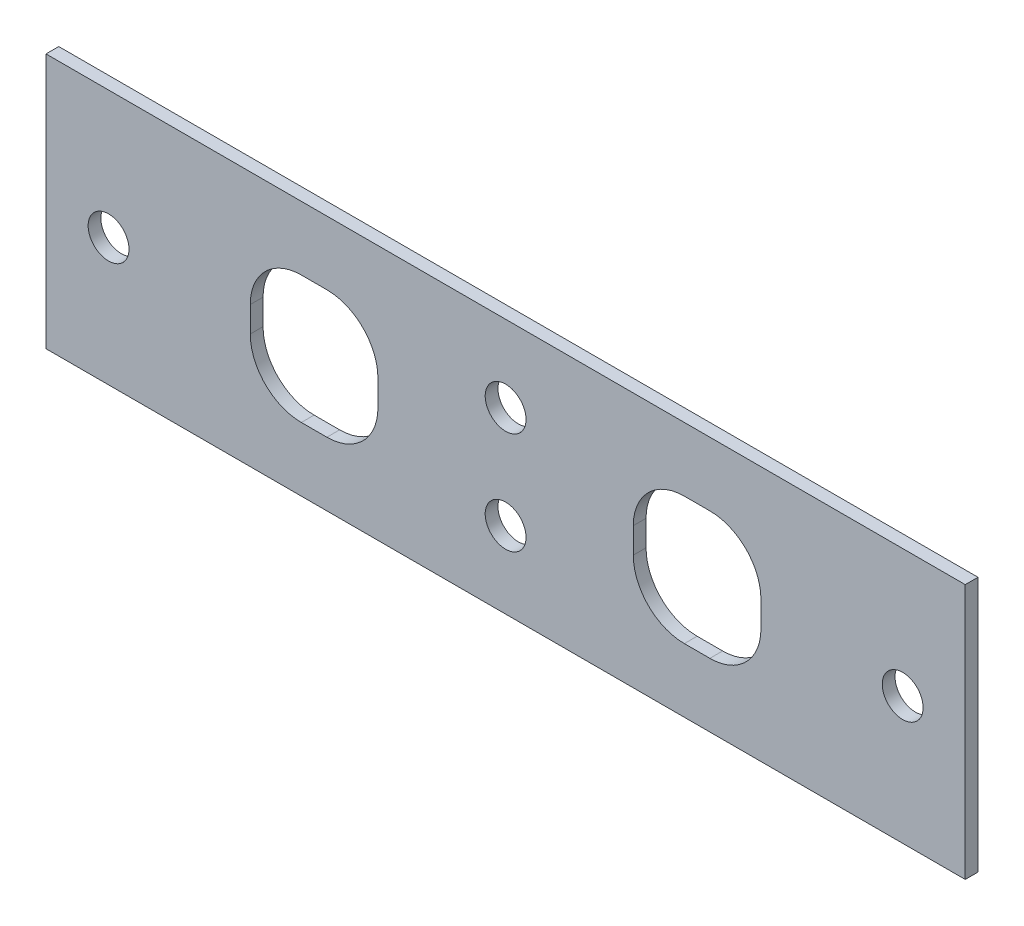
ISO-10303-21;
HEADER;
FILE_DESCRIPTION(('STEP AP214'),'2;1');
FILE_NAME('part.step','',(''),(''),'','','');
FILE_SCHEMA(('AUTOMOTIVE_DESIGN { 1 0 10303 214 1 1 1 1 }'));
ENDSEC;
DATA;
#1=APPLICATION_CONTEXT('core data for automotive mechanical design processes');
#2=APPLICATION_PROTOCOL_DEFINITION('international standard','automotive_design',2000,#1);
#3=PRODUCT_CONTEXT('',#1,'mechanical');
#4=PRODUCT('Part','Part','',(#3));
#5=PRODUCT_RELATED_PRODUCT_CATEGORY('part','',(#4));
#6=PRODUCT_DEFINITION_FORMATION('','',#4);
#7=PRODUCT_DEFINITION_CONTEXT('part definition',#1,'design');
#8=PRODUCT_DEFINITION('design','',#6,#7);
#9=PRODUCT_DEFINITION_SHAPE('','',#8);
#10=(LENGTH_UNIT() NAMED_UNIT(*) SI_UNIT(.MILLI.,.METRE.));
#11=(NAMED_UNIT(*) PLANE_ANGLE_UNIT() SI_UNIT($,.RADIAN.));
#12=(NAMED_UNIT(*) SI_UNIT($,.STERADIAN.) SOLID_ANGLE_UNIT());
#13=UNCERTAINTY_MEASURE_WITH_UNIT(LENGTH_MEASURE(1.E-05),#10,'distance_accuracy_value','');
#14=(GEOMETRIC_REPRESENTATION_CONTEXT(3) GLOBAL_UNCERTAINTY_ASSIGNED_CONTEXT((#13)) GLOBAL_UNIT_ASSIGNED_CONTEXT((#10,
#11,#12)) REPRESENTATION_CONTEXT('',''));
#15=CARTESIAN_POINT('',(0.,0.,0.));
#16=DIRECTION('',(0.,0.,1.));
#17=DIRECTION('',(1.,0.,0.));
#18=AXIS2_PLACEMENT_3D('',#15,#16,#17);
#19=CARTESIAN_POINT('',(0.,0.,0.));
#20=DIRECTION('',(0.,0.,1.));
#21=DIRECTION('',(1.,0.,0.));
#22=AXIS2_PLACEMENT_3D('',#19,#20,#21);
#23=PLANE('',#22);
#24=CARTESIAN_POINT('',(31.1,0.,0.));
#25=DIRECTION('',(0.,0.,1.));
#26=DIRECTION('',(1.,0.,0.));
#27=AXIS2_PLACEMENT_3D('',#24,#25,#26);
#28=CIRCLE('',#27,1.6);
#29=CARTESIAN_POINT('',(32.7,0.,0.));
#30=VERTEX_POINT('',#29);
#31=EDGE_CURVE('E247',#30,#30,#28,.T.);
#32=ORIENTED_EDGE('',*,*,#31,.T.);
#33=EDGE_LOOP('',(#32));
#34=FACE_BOUND('',#33,.T.);
#35=CARTESIAN_POINT('',(-31.1,0.,0.));
#36=DIRECTION('',(0.,0.,1.));
#37=DIRECTION('',(1.,0.,0.));
#38=AXIS2_PLACEMENT_3D('',#35,#36,#37);
#39=CIRCLE('',#38,1.6);
#40=CARTESIAN_POINT('',(-29.5,0.,0.));
#41=VERTEX_POINT('',#40);
#42=EDGE_CURVE('E251',#41,#41,#39,.T.);
#43=ORIENTED_EDGE('',*,*,#42,.T.);
#44=EDGE_LOOP('',(#43));
#45=FACE_BOUND('',#44,.T.);
#46=CARTESIAN_POINT('',(0.,-3.99999999999999,0.));
#47=DIRECTION('',(0.,0.,1.));
#48=DIRECTION('',(1.,0.,0.));
#49=AXIS2_PLACEMENT_3D('',#46,#47,#48);
#50=CIRCLE('',#49,1.6);
#51=CARTESIAN_POINT('',(1.6,-3.99999999999999,0.));
#52=VERTEX_POINT('',#51);
#53=EDGE_CURVE('E254',#52,#52,#50,.T.);
#54=ORIENTED_EDGE('',*,*,#53,.T.);
#55=EDGE_LOOP('',(#54));
#56=FACE_BOUND('',#55,.T.);
#57=CARTESIAN_POINT('',(0.,3.99999999999999,0.));
#58=DIRECTION('',(0.,0.,1.));
#59=DIRECTION('',(1.,0.,0.));
#60=AXIS2_PLACEMENT_3D('',#57,#58,#59);
#61=CIRCLE('',#60,1.6);
#62=CARTESIAN_POINT('',(1.6,3.99999999999999,0.));
#63=VERTEX_POINT('',#62);
#64=EDGE_CURVE('E257',#63,#63,#61,.T.);
#65=ORIENTED_EDGE('',*,*,#64,.T.);
#66=EDGE_LOOP('',(#65));
#67=FACE_BOUND('',#66,.T.);
#68=DIRECTION('',(1.,0.,0.));
#69=VECTOR('',#68,1.);
#70=CARTESIAN_POINT('',(16.,-5.,0.));
#71=LINE('',#70,#69);
#72=CARTESIAN_POINT('',(14.,-5.,0.));
#73=VERTEX_POINT('',#72);
#74=CARTESIAN_POINT('',(16.,-5.,0.));
#75=VERTEX_POINT('',#74);
#76=EDGE_CURVE('E177',#73,#75,#71,.T.);
#77=ORIENTED_EDGE('',*,*,#76,.T.);
#78=CARTESIAN_POINT('',(16.,-1.,0.));
#79=DIRECTION('',(0.,0.,-1.));
#80=DIRECTION('',(-1.,0.,0.));
#81=AXIS2_PLACEMENT_3D('',#78,#79,#80);
#82=CIRCLE('',#81,4.);
#83=CARTESIAN_POINT('',(20.,-1.,0.));
#84=VERTEX_POINT('',#83);
#85=EDGE_CURVE('E260',#75,#84,#82,.F.);
#86=ORIENTED_EDGE('',*,*,#85,.T.);
#87=DIRECTION('',(0.,1.,0.));
#88=VECTOR('',#87,1.);
#89=CARTESIAN_POINT('',(20.,0.999999999999999,0.));
#90=LINE('',#89,#88);
#91=CARTESIAN_POINT('',(20.,1.,0.));
#92=VERTEX_POINT('',#91);
#93=EDGE_CURVE('E180',#84,#92,#90,.T.);
#94=ORIENTED_EDGE('',*,*,#93,.T.);
#95=CARTESIAN_POINT('',(16.,1.,0.));
#96=DIRECTION('',(0.,0.,-1.));
#97=DIRECTION('',(-1.,0.,0.));
#98=AXIS2_PLACEMENT_3D('',#95,#96,#97);
#99=CIRCLE('',#98,4.);
#100=CARTESIAN_POINT('',(16.,5.,0.));
#101=VERTEX_POINT('',#100);
#102=EDGE_CURVE('E263',#92,#101,#99,.F.);
#103=ORIENTED_EDGE('',*,*,#102,.T.);
#104=DIRECTION('',(-1.,0.,0.));
#105=VECTOR('',#104,1.);
#106=CARTESIAN_POINT('',(14.,5.,0.));
#107=LINE('',#106,#105);
#108=CARTESIAN_POINT('',(14.,5.,0.));
#109=VERTEX_POINT('',#108);
#110=EDGE_CURVE('E184',#101,#109,#107,.T.);
#111=ORIENTED_EDGE('',*,*,#110,.T.);
#112=CARTESIAN_POINT('',(14.,1.,0.));
#113=DIRECTION('',(0.,0.,-1.));
#114=DIRECTION('',(-1.,0.,0.));
#115=AXIS2_PLACEMENT_3D('',#112,#113,#114);
#116=CIRCLE('',#115,4.);
#117=CARTESIAN_POINT('',(10.,1.,0.));
#118=VERTEX_POINT('',#117);
#119=EDGE_CURVE('E265',#109,#118,#116,.F.);
#120=ORIENTED_EDGE('',*,*,#119,.T.);
#121=DIRECTION('',(0.,1.,0.));
#122=VECTOR('',#121,1.);
#123=CARTESIAN_POINT('',(10.,-1.,0.));
#124=LINE('',#123,#122);
#125=CARTESIAN_POINT('',(10.,-1.,0.));
#126=VERTEX_POINT('',#125);
#127=EDGE_CURVE('E188',#118,#126,#124,.F.);
#128=ORIENTED_EDGE('',*,*,#127,.T.);
#129=CARTESIAN_POINT('',(14.,-1.,0.));
#130=DIRECTION('',(0.,0.,-1.));
#131=DIRECTION('',(-1.,0.,0.));
#132=AXIS2_PLACEMENT_3D('',#129,#130,#131);
#133=CIRCLE('',#132,4.);
#134=EDGE_CURVE('E191',#126,#73,#133,.F.);
#135=ORIENTED_EDGE('',*,*,#134,.T.);
#136=EDGE_LOOP('',(#77,#86,#94,#103,#111,#120,#128,#135));
#137=FACE_BOUND('',#136,.T.);
#138=DIRECTION('',(1.,0.,0.));
#139=VECTOR('',#138,1.);
#140=CARTESIAN_POINT('',(-14.,-5.,0.));
#141=LINE('',#140,#139);
#142=CARTESIAN_POINT('',(-16.,-5.,0.));
#143=VERTEX_POINT('',#142);
#144=CARTESIAN_POINT('',(-14.,-5.,0.));
#145=VERTEX_POINT('',#144);
#146=EDGE_CURVE('E192',#143,#145,#141,.T.);
#147=ORIENTED_EDGE('',*,*,#146,.T.);
#148=CARTESIAN_POINT('',(-14.,-1.,0.));
#149=DIRECTION('',(0.,0.,-1.));
#150=DIRECTION('',(-1.,0.,0.));
#151=AXIS2_PLACEMENT_3D('',#148,#149,#150);
#152=CIRCLE('',#151,4.);
#153=CARTESIAN_POINT('',(-10.,-1.,0.));
#154=VERTEX_POINT('',#153);
#155=EDGE_CURVE('E268',#145,#154,#152,.F.);
#156=ORIENTED_EDGE('',*,*,#155,.T.);
#157=DIRECTION('',(0.,1.,0.));
#158=VECTOR('',#157,1.);
#159=CARTESIAN_POINT('',(-10.,1.,0.));
#160=LINE('',#159,#158);
#161=CARTESIAN_POINT('',(-10.,1.,0.));
#162=VERTEX_POINT('',#161);
#163=EDGE_CURVE('E196',#154,#162,#160,.T.);
#164=ORIENTED_EDGE('',*,*,#163,.T.);
#165=CARTESIAN_POINT('',(-14.,1.,0.));
#166=DIRECTION('',(0.,0.,-1.));
#167=DIRECTION('',(-1.,0.,0.));
#168=AXIS2_PLACEMENT_3D('',#165,#166,#167);
#169=CIRCLE('',#168,4.);
#170=CARTESIAN_POINT('',(-14.,5.,0.));
#171=VERTEX_POINT('',#170);
#172=EDGE_CURVE('E271',#162,#171,#169,.F.);
#173=ORIENTED_EDGE('',*,*,#172,.T.);
#174=DIRECTION('',(-1.,0.,0.));
#175=VECTOR('',#174,1.);
#176=CARTESIAN_POINT('',(-16.,5.,0.));
#177=LINE('',#176,#175);
#178=CARTESIAN_POINT('',(-16.,5.,0.));
#179=VERTEX_POINT('',#178);
#180=EDGE_CURVE('E200',#171,#179,#177,.T.);
#181=ORIENTED_EDGE('',*,*,#180,.T.);
#182=CARTESIAN_POINT('',(-16.,1.,0.));
#183=DIRECTION('',(0.,0.,-1.));
#184=DIRECTION('',(-1.,0.,0.));
#185=AXIS2_PLACEMENT_3D('',#182,#183,#184);
#186=CIRCLE('',#185,4.);
#187=CARTESIAN_POINT('',(-20.,1.,0.));
#188=VERTEX_POINT('',#187);
#189=EDGE_CURVE('E272',#179,#188,#186,.F.);
#190=ORIENTED_EDGE('',*,*,#189,.T.);
#191=DIRECTION('',(0.,1.,0.));
#192=VECTOR('',#191,1.);
#193=CARTESIAN_POINT('',(-20.,-1.,0.));
#194=LINE('',#193,#192);
#195=CARTESIAN_POINT('',(-20.,-1.,0.));
#196=VERTEX_POINT('',#195);
#197=EDGE_CURVE('E131',#188,#196,#194,.F.);
#198=ORIENTED_EDGE('',*,*,#197,.T.);
#199=CARTESIAN_POINT('',(-16.,-1.,0.));
#200=DIRECTION('',(0.,0.,-1.));
#201=DIRECTION('',(-1.,0.,0.));
#202=AXIS2_PLACEMENT_3D('',#199,#200,#201);
#203=CIRCLE('',#202,4.);
#204=EDGE_CURVE('E19',#196,#143,#203,.F.);
#205=ORIENTED_EDGE('',*,*,#204,.T.);
#206=EDGE_LOOP('',(#147,#156,#164,#173,#181,#190,#198,#205));
#207=FACE_BOUND('',#206,.T.);
#208=DIRECTION('',(0.,1.,0.));
#209=VECTOR('',#208,1.);
#210=CARTESIAN_POINT('',(36.,10.,0.));
#211=LINE('',#210,#209);
#212=CARTESIAN_POINT('',(36.,-9.99999999999999,0.));
#213=VERTEX_POINT('',#212);
#214=CARTESIAN_POINT('',(36.,10.,0.));
#215=VERTEX_POINT('',#214);
#216=EDGE_CURVE('E140',#213,#215,#211,.T.);
#217=ORIENTED_EDGE('',*,*,#216,.F.);
#218=DIRECTION('',(1.,0.,0.));
#219=VECTOR('',#218,1.);
#220=CARTESIAN_POINT('',(36.,-10.,0.));
#221=LINE('',#220,#219);
#222=CARTESIAN_POINT('',(-36.,-9.99999999999999,0.));
#223=VERTEX_POINT('',#222);
#224=EDGE_CURVE('E282',#223,#213,#221,.T.);
#225=ORIENTED_EDGE('',*,*,#224,.F.);
#226=DIRECTION('',(0.,-1.,0.));
#227=VECTOR('',#226,1.);
#228=CARTESIAN_POINT('',(-36.,-9.99999999999999,0.));
#229=LINE('',#228,#227);
#230=CARTESIAN_POINT('',(-36.,10.,0.));
#231=VERTEX_POINT('',#230);
#232=EDGE_CURVE('E164',#231,#223,#229,.T.);
#233=ORIENTED_EDGE('',*,*,#232,.F.);
#234=DIRECTION('',(1.,0.,0.));
#235=VECTOR('',#234,1.);
#236=CARTESIAN_POINT('',(-36.,10.,0.));
#237=LINE('',#236,#235);
#238=EDGE_CURVE('E163',#215,#231,#237,.F.);
#239=ORIENTED_EDGE('',*,*,#238,.F.);
#240=EDGE_LOOP('',(#217,#225,#233,#239));
#241=FACE_BOUND('',#240,.T.);
#242=ADVANCED_FACE('F16',(#34,#45,#56,#67,#137,#207,#241),#23,.F.);
#243=CARTESIAN_POINT('',(36.,10.,0.));
#244=DIRECTION('',(1.,0.,0.));
#245=DIRECTION('',(0.,1.,0.));
#246=AXIS2_PLACEMENT_3D('',#243,#244,#245);
#247=PLANE('',#246);
#248=ORIENTED_EDGE('',*,*,#216,.T.);
#249=DIRECTION('',(0.,0.,1.));
#250=VECTOR('',#249,1.);
#251=CARTESIAN_POINT('',(36.,10.,0.));
#252=LINE('',#251,#250);
#253=CARTESIAN_POINT('',(36.,10.,1.));
#254=VERTEX_POINT('',#253);
#255=EDGE_CURVE('E156',#254,#215,#252,.F.);
#256=ORIENTED_EDGE('',*,*,#255,.F.);
#257=DIRECTION('',(0.,1.,0.));
#258=VECTOR('',#257,1.);
#259=CARTESIAN_POINT('',(36.,0.,1.));
#260=LINE('',#259,#258);
#261=CARTESIAN_POINT('',(36.,-10.,1.));
#262=VERTEX_POINT('',#261);
#263=EDGE_CURVE('E250',#262,#254,#260,.T.);
#264=ORIENTED_EDGE('',*,*,#263,.F.);
#265=DIRECTION('',(0.,0.,1.));
#266=VECTOR('',#265,1.);
#267=CARTESIAN_POINT('',(36.,-10.,0.));
#268=LINE('',#267,#266);
#269=EDGE_CURVE('E159',#213,#262,#268,.T.);
#270=ORIENTED_EDGE('',*,*,#269,.F.);
#271=EDGE_LOOP('',(#248,#256,#264,#270));
#272=FACE_BOUND('',#271,.T.);
#273=ADVANCED_FACE('F153',(#272),#247,.T.);
#274=CARTESIAN_POINT('',(-36.,10.,0.));
#275=DIRECTION('',(0.,1.,0.));
#276=DIRECTION('',(0.,0.,1.));
#277=AXIS2_PLACEMENT_3D('',#274,#275,#276);
#278=PLANE('',#277);
#279=ORIENTED_EDGE('',*,*,#238,.T.);
#280=DIRECTION('',(0.,0.,1.));
#281=VECTOR('',#280,1.);
#282=CARTESIAN_POINT('',(-36.,10.,0.));
#283=LINE('',#282,#281);
#284=CARTESIAN_POINT('',(-36.,10.,1.));
#285=VERTEX_POINT('',#284);
#286=EDGE_CURVE('E168',#285,#231,#283,.F.);
#287=ORIENTED_EDGE('',*,*,#286,.F.);
#288=DIRECTION('',(1.,0.,0.));
#289=VECTOR('',#288,1.);
#290=CARTESIAN_POINT('',(0.,10.,1.));
#291=LINE('',#290,#289);
#292=EDGE_CURVE('E172',#254,#285,#291,.F.);
#293=ORIENTED_EDGE('',*,*,#292,.F.);
#294=ORIENTED_EDGE('',*,*,#255,.T.);
#295=EDGE_LOOP('',(#279,#287,#293,#294));
#296=FACE_BOUND('',#295,.T.);
#297=ADVANCED_FACE('F170',(#296),#278,.T.);
#298=CARTESIAN_POINT('',(-36.,-9.99999999999999,0.));
#299=DIRECTION('',(-1.,0.,0.));
#300=DIRECTION('',(0.,-1.,0.));
#301=AXIS2_PLACEMENT_3D('',#298,#299,#300);
#302=PLANE('',#301);
#303=ORIENTED_EDGE('',*,*,#232,.T.);
#304=DIRECTION('',(0.,0.,1.));
#305=VECTOR('',#304,1.);
#306=CARTESIAN_POINT('',(-36.,-9.99999999999999,0.));
#307=LINE('',#306,#305);
#308=CARTESIAN_POINT('',(-36.,-9.99999999999999,1.));
#309=VERTEX_POINT('',#308);
#310=EDGE_CURVE('E284',#309,#223,#307,.F.);
#311=ORIENTED_EDGE('',*,*,#310,.F.);
#312=DIRECTION('',(0.,1.,0.));
#313=VECTOR('',#312,1.);
#314=CARTESIAN_POINT('',(-36.,0.,1.));
#315=LINE('',#314,#313);
#316=EDGE_CURVE('E293',#285,#309,#315,.F.);
#317=ORIENTED_EDGE('',*,*,#316,.F.);
#318=ORIENTED_EDGE('',*,*,#286,.T.);
#319=EDGE_LOOP('',(#303,#311,#317,#318));
#320=FACE_BOUND('',#319,.T.);
#321=ADVANCED_FACE('F289',(#320),#302,.T.);
#322=CARTESIAN_POINT('',(36.,-10.,0.));
#323=DIRECTION('',(0.,-1.,0.));
#324=DIRECTION('',(1.,0.,0.));
#325=AXIS2_PLACEMENT_3D('',#322,#323,#324);
#326=PLANE('',#325);
#327=ORIENTED_EDGE('',*,*,#224,.T.);
#328=ORIENTED_EDGE('',*,*,#269,.T.);
#329=DIRECTION('',(1.,0.,0.));
#330=VECTOR('',#329,1.);
#331=CARTESIAN_POINT('',(0.,-9.99999999999999,1.));
#332=LINE('',#331,#330);
#333=EDGE_CURVE('E246',#309,#262,#332,.T.);
#334=ORIENTED_EDGE('',*,*,#333,.F.);
#335=ORIENTED_EDGE('',*,*,#310,.T.);
#336=EDGE_LOOP('',(#327,#328,#334,#335));
#337=FACE_BOUND('',#336,.T.);
#338=ADVANCED_FACE('F301',(#337),#326,.T.);
#339=CARTESIAN_POINT('',(-16.,-1.,1.));
#340=DIRECTION('',(0.,0.,-1.));
#341=DIRECTION('',(-1.,0.,0.));
#342=AXIS2_PLACEMENT_3D('',#339,#340,#341);
#343=CYLINDRICAL_SURFACE('',#342,4.);
#344=DIRECTION('',(0.,0.,1.));
#345=VECTOR('',#344,1.);
#346=CARTESIAN_POINT('',(-16.,-5.,1.));
#347=LINE('',#346,#345);
#348=CARTESIAN_POINT('',(-16.,-5.,1.));
#349=VERTEX_POINT('',#348);
#350=EDGE_CURVE('E195',#349,#143,#347,.F.);
#351=ORIENTED_EDGE('',*,*,#350,.T.);
#352=ORIENTED_EDGE('',*,*,#204,.F.);
#353=DIRECTION('',(0.,0.,1.));
#354=VECTOR('',#353,1.);
#355=CARTESIAN_POINT('',(-20.,-1.,1.));
#356=LINE('',#355,#354);
#357=CARTESIAN_POINT('',(-20.,-1.,1.));
#358=VERTEX_POINT('',#357);
#359=EDGE_CURVE('E204',#196,#358,#356,.T.);
#360=ORIENTED_EDGE('',*,*,#359,.T.);
#361=CARTESIAN_POINT('',(-16.,-1.,1.));
#362=DIRECTION('',(0.,0.,-1.));
#363=DIRECTION('',(-1.,0.,0.));
#364=AXIS2_PLACEMENT_3D('',#361,#362,#363);
#365=CIRCLE('',#364,4.);
#366=EDGE_CURVE('E243',#349,#358,#365,.T.);
#367=ORIENTED_EDGE('',*,*,#366,.F.);
#368=EDGE_LOOP('',(#351,#352,#360,#367));
#369=FACE_BOUND('',#368,.T.);
#370=ADVANCED_FACE('F341',(#369),#343,.F.);
#371=CARTESIAN_POINT('',(-20.,-1.,1.));
#372=DIRECTION('',(-1.,0.,0.));
#373=DIRECTION('',(0.,0.,1.));
#374=AXIS2_PLACEMENT_3D('',#371,#372,#373);
#375=PLANE('',#374);
#376=ORIENTED_EDGE('',*,*,#359,.F.);
#377=ORIENTED_EDGE('',*,*,#197,.F.);
#378=DIRECTION('',(0.,0.,-1.));
#379=VECTOR('',#378,1.);
#380=CARTESIAN_POINT('',(-20.,1.,1.));
#381=LINE('',#380,#379);
#382=CARTESIAN_POINT('',(-20.,1.,1.));
#383=VERTEX_POINT('',#382);
#384=EDGE_CURVE('E203',#188,#383,#381,.F.);
#385=ORIENTED_EDGE('',*,*,#384,.T.);
#386=DIRECTION('',(0.,1.,0.));
#387=VECTOR('',#386,1.);
#388=CARTESIAN_POINT('',(-20.,0.,1.));
#389=LINE('',#388,#387);
#390=EDGE_CURVE('E242',#358,#383,#389,.T.);
#391=ORIENTED_EDGE('',*,*,#390,.F.);
#392=EDGE_LOOP('',(#376,#377,#385,#391));
#393=FACE_BOUND('',#392,.T.);
#394=ADVANCED_FACE('F339',(#393),#375,.F.);
#395=CARTESIAN_POINT('',(-16.,1.,1.));
#396=DIRECTION('',(0.,0.,-1.));
#397=DIRECTION('',(-1.,0.,0.));
#398=AXIS2_PLACEMENT_3D('',#395,#396,#397);
#399=CYLINDRICAL_SURFACE('',#398,4.);
#400=ORIENTED_EDGE('',*,*,#384,.F.);
#401=ORIENTED_EDGE('',*,*,#189,.F.);
#402=DIRECTION('',(0.,0.,1.));
#403=VECTOR('',#402,1.);
#404=CARTESIAN_POINT('',(-16.,5.,1.));
#405=LINE('',#404,#403);
#406=CARTESIAN_POINT('',(-16.,5.,1.));
#407=VERTEX_POINT('',#406);
#408=EDGE_CURVE('E202',#179,#407,#405,.T.);
#409=ORIENTED_EDGE('',*,*,#408,.T.);
#410=CARTESIAN_POINT('',(-16.,1.,1.));
#411=DIRECTION('',(0.,0.,-1.));
#412=DIRECTION('',(-1.,0.,0.));
#413=AXIS2_PLACEMENT_3D('',#410,#411,#412);
#414=CIRCLE('',#413,4.);
#415=EDGE_CURVE('E239',#383,#407,#414,.T.);
#416=ORIENTED_EDGE('',*,*,#415,.F.);
#417=EDGE_LOOP('',(#400,#401,#409,#416));
#418=FACE_BOUND('',#417,.T.);
#419=ADVANCED_FACE('F328',(#418),#399,.F.);
#420=CARTESIAN_POINT('',(-16.,5.,1.));
#421=DIRECTION('',(0.,1.,0.));
#422=DIRECTION('',(-1.,0.,0.));
#423=AXIS2_PLACEMENT_3D('',#420,#421,#422);
#424=PLANE('',#423);
#425=ORIENTED_EDGE('',*,*,#408,.F.);
#426=ORIENTED_EDGE('',*,*,#180,.F.);
#427=DIRECTION('',(0.,0.,-1.));
#428=VECTOR('',#427,1.);
#429=CARTESIAN_POINT('',(-14.,5.,1.));
#430=LINE('',#429,#428);
#431=CARTESIAN_POINT('',(-14.,5.,1.));
#432=VERTEX_POINT('',#431);
#433=EDGE_CURVE('E199',#171,#432,#430,.F.);
#434=ORIENTED_EDGE('',*,*,#433,.T.);
#435=DIRECTION('',(1.,0.,0.));
#436=VECTOR('',#435,1.);
#437=CARTESIAN_POINT('',(0.,5.,1.));
#438=LINE('',#437,#436);
#439=EDGE_CURVE('E238',#407,#432,#438,.T.);
#440=ORIENTED_EDGE('',*,*,#439,.F.);
#441=EDGE_LOOP('',(#425,#426,#434,#440));
#442=FACE_BOUND('',#441,.T.);
#443=ADVANCED_FACE('F333',(#442),#424,.F.);
#444=CARTESIAN_POINT('',(-14.,1.,1.));
#445=DIRECTION('',(0.,0.,-1.));
#446=DIRECTION('',(-1.,0.,0.));
#447=AXIS2_PLACEMENT_3D('',#444,#445,#446);
#448=CYLINDRICAL_SURFACE('',#447,4.);
#449=ORIENTED_EDGE('',*,*,#433,.F.);
#450=ORIENTED_EDGE('',*,*,#172,.F.);
#451=DIRECTION('',(0.,0.,-1.));
#452=VECTOR('',#451,1.);
#453=CARTESIAN_POINT('',(-10.,1.,1.));
#454=LINE('',#453,#452);
#455=CARTESIAN_POINT('',(-10.,1.,1.));
#456=VERTEX_POINT('',#455);
#457=EDGE_CURVE('E198',#162,#456,#454,.F.);
#458=ORIENTED_EDGE('',*,*,#457,.T.);
#459=CARTESIAN_POINT('',(-14.,1.,1.));
#460=DIRECTION('',(0.,0.,-1.));
#461=DIRECTION('',(-1.,0.,0.));
#462=AXIS2_PLACEMENT_3D('',#459,#460,#461);
#463=CIRCLE('',#462,4.);
#464=EDGE_CURVE('E235',#432,#456,#463,.T.);
#465=ORIENTED_EDGE('',*,*,#464,.F.);
#466=EDGE_LOOP('',(#449,#450,#458,#465));
#467=FACE_BOUND('',#466,.T.);
#468=ADVANCED_FACE('F415',(#467),#448,.F.);
#469=CARTESIAN_POINT('',(-10.,1.,1.));
#470=DIRECTION('',(1.,0.,0.));
#471=DIRECTION('',(0.,0.,-1.));
#472=AXIS2_PLACEMENT_3D('',#469,#470,#471);
#473=PLANE('',#472);
#474=ORIENTED_EDGE('',*,*,#457,.F.);
#475=ORIENTED_EDGE('',*,*,#163,.F.);
#476=DIRECTION('',(0.,0.,-1.));
#477=VECTOR('',#476,1.);
#478=CARTESIAN_POINT('',(-10.,-1.,1.));
#479=LINE('',#478,#477);
#480=CARTESIAN_POINT('',(-10.,-1.,1.));
#481=VERTEX_POINT('',#480);
#482=EDGE_CURVE('E270',#154,#481,#479,.F.);
#483=ORIENTED_EDGE('',*,*,#482,.T.);
#484=DIRECTION('',(0.,1.,0.));
#485=VECTOR('',#484,1.);
#486=CARTESIAN_POINT('',(-10.,0.,1.));
#487=LINE('',#486,#485);
#488=EDGE_CURVE('E234',#456,#481,#487,.F.);
#489=ORIENTED_EDGE('',*,*,#488,.F.);
#490=EDGE_LOOP('',(#474,#475,#483,#489));
#491=FACE_BOUND('',#490,.T.);
#492=ADVANCED_FACE('F411',(#491),#473,.F.);
#493=CARTESIAN_POINT('',(-14.,-1.,1.));
#494=DIRECTION('',(0.,0.,-1.));
#495=DIRECTION('',(-1.,0.,0.));
#496=AXIS2_PLACEMENT_3D('',#493,#494,#495);
#497=CYLINDRICAL_SURFACE('',#496,4.);
#498=ORIENTED_EDGE('',*,*,#482,.F.);
#499=ORIENTED_EDGE('',*,*,#155,.F.);
#500=DIRECTION('',(0.,0.,1.));
#501=VECTOR('',#500,1.);
#502=CARTESIAN_POINT('',(-14.,-5.,1.));
#503=LINE('',#502,#501);
#504=CARTESIAN_POINT('',(-14.,-5.,1.));
#505=VERTEX_POINT('',#504);
#506=EDGE_CURVE('E194',#145,#505,#503,.T.);
#507=ORIENTED_EDGE('',*,*,#506,.T.);
#508=CARTESIAN_POINT('',(-14.,-1.,1.));
#509=DIRECTION('',(0.,0.,-1.));
#510=DIRECTION('',(-1.,0.,0.));
#511=AXIS2_PLACEMENT_3D('',#508,#509,#510);
#512=CIRCLE('',#511,4.);
#513=EDGE_CURVE('E231',#481,#505,#512,.T.);
#514=ORIENTED_EDGE('',*,*,#513,.F.);
#515=EDGE_LOOP('',(#498,#499,#507,#514));
#516=FACE_BOUND('',#515,.T.);
#517=ADVANCED_FACE('F407',(#516),#497,.F.);
#518=CARTESIAN_POINT('',(-14.,-5.,1.));
#519=DIRECTION('',(0.,-1.,0.));
#520=DIRECTION('',(1.,0.,0.));
#521=AXIS2_PLACEMENT_3D('',#518,#519,#520);
#522=PLANE('',#521);
#523=ORIENTED_EDGE('',*,*,#506,.F.);
#524=ORIENTED_EDGE('',*,*,#146,.F.);
#525=ORIENTED_EDGE('',*,*,#350,.F.);
#526=DIRECTION('',(1.,0.,0.));
#527=VECTOR('',#526,1.);
#528=CARTESIAN_POINT('',(0.,-5.,1.));
#529=LINE('',#528,#527);
#530=EDGE_CURVE('E230',#505,#349,#529,.F.);
#531=ORIENTED_EDGE('',*,*,#530,.F.);
#532=EDGE_LOOP('',(#523,#524,#525,#531));
#533=FACE_BOUND('',#532,.T.);
#534=ADVANCED_FACE('F403',(#533),#522,.F.);
#535=CARTESIAN_POINT('',(14.,-1.,1.));
#536=DIRECTION('',(0.,0.,-1.));
#537=DIRECTION('',(-1.,0.,0.));
#538=AXIS2_PLACEMENT_3D('',#535,#536,#537);
#539=CYLINDRICAL_SURFACE('',#538,4.);
#540=DIRECTION('',(0.,0.,1.));
#541=VECTOR('',#540,1.);
#542=CARTESIAN_POINT('',(14.,-5.,1.));
#543=LINE('',#542,#541);
#544=CARTESIAN_POINT('',(14.,-5.,1.));
#545=VERTEX_POINT('',#544);
#546=EDGE_CURVE('E179',#545,#73,#543,.F.);
#547=ORIENTED_EDGE('',*,*,#546,.T.);
#548=ORIENTED_EDGE('',*,*,#134,.F.);
#549=DIRECTION('',(0.,0.,1.));
#550=VECTOR('',#549,1.);
#551=CARTESIAN_POINT('',(10.,-1.,1.));
#552=LINE('',#551,#550);
#553=CARTESIAN_POINT('',(10.,-1.,1.));
#554=VERTEX_POINT('',#553);
#555=EDGE_CURVE('E190',#126,#554,#552,.T.);
#556=ORIENTED_EDGE('',*,*,#555,.T.);
#557=CARTESIAN_POINT('',(14.,-1.,1.));
#558=DIRECTION('',(0.,0.,-1.));
#559=DIRECTION('',(-1.,0.,0.));
#560=AXIS2_PLACEMENT_3D('',#557,#558,#559);
#561=CIRCLE('',#560,4.);
#562=EDGE_CURVE('E227',#545,#554,#561,.T.);
#563=ORIENTED_EDGE('',*,*,#562,.F.);
#564=EDGE_LOOP('',(#547,#548,#556,#563));
#565=FACE_BOUND('',#564,.T.);
#566=ADVANCED_FACE('F399',(#565),#539,.F.);
#567=CARTESIAN_POINT('',(10.,-1.,1.));
#568=DIRECTION('',(-1.,0.,0.));
#569=DIRECTION('',(0.,0.,1.));
#570=AXIS2_PLACEMENT_3D('',#567,#568,#569);
#571=PLANE('',#570);
#572=ORIENTED_EDGE('',*,*,#555,.F.);
#573=ORIENTED_EDGE('',*,*,#127,.F.);
#574=DIRECTION('',(0.,0.,-1.));
#575=VECTOR('',#574,1.);
#576=CARTESIAN_POINT('',(10.,1.,1.));
#577=LINE('',#576,#575);
#578=CARTESIAN_POINT('',(10.,1.,1.));
#579=VERTEX_POINT('',#578);
#580=EDGE_CURVE('E187',#118,#579,#577,.F.);
#581=ORIENTED_EDGE('',*,*,#580,.T.);
#582=DIRECTION('',(0.,1.,0.));
#583=VECTOR('',#582,1.);
#584=CARTESIAN_POINT('',(10.,0.,1.));
#585=LINE('',#584,#583);
#586=EDGE_CURVE('E226',#554,#579,#585,.T.);
#587=ORIENTED_EDGE('',*,*,#586,.F.);
#588=EDGE_LOOP('',(#572,#573,#581,#587));
#589=FACE_BOUND('',#588,.T.);
#590=ADVANCED_FACE('F395',(#589),#571,.F.);
#591=CARTESIAN_POINT('',(14.,1.,1.));
#592=DIRECTION('',(0.,0.,-1.));
#593=DIRECTION('',(-1.,0.,0.));
#594=AXIS2_PLACEMENT_3D('',#591,#592,#593);
#595=CYLINDRICAL_SURFACE('',#594,4.);
#596=ORIENTED_EDGE('',*,*,#580,.F.);
#597=ORIENTED_EDGE('',*,*,#119,.F.);
#598=DIRECTION('',(0.,0.,1.));
#599=VECTOR('',#598,1.);
#600=CARTESIAN_POINT('',(14.,5.,1.));
#601=LINE('',#600,#599);
#602=CARTESIAN_POINT('',(14.,5.,1.));
#603=VERTEX_POINT('',#602);
#604=EDGE_CURVE('E186',#109,#603,#601,.T.);
#605=ORIENTED_EDGE('',*,*,#604,.T.);
#606=CARTESIAN_POINT('',(14.,1.,1.));
#607=DIRECTION('',(0.,0.,-1.));
#608=DIRECTION('',(-1.,0.,0.));
#609=AXIS2_PLACEMENT_3D('',#606,#607,#608);
#610=CIRCLE('',#609,4.);
#611=EDGE_CURVE('E223',#579,#603,#610,.T.);
#612=ORIENTED_EDGE('',*,*,#611,.F.);
#613=EDGE_LOOP('',(#596,#597,#605,#612));
#614=FACE_BOUND('',#613,.T.);
#615=ADVANCED_FACE('F391',(#614),#595,.F.);
#616=CARTESIAN_POINT('',(14.,5.,1.));
#617=DIRECTION('',(0.,1.,0.));
#618=DIRECTION('',(-1.,0.,0.));
#619=AXIS2_PLACEMENT_3D('',#616,#617,#618);
#620=PLANE('',#619);
#621=ORIENTED_EDGE('',*,*,#604,.F.);
#622=ORIENTED_EDGE('',*,*,#110,.F.);
#623=DIRECTION('',(0.,0.,-1.));
#624=VECTOR('',#623,1.);
#625=CARTESIAN_POINT('',(16.,5.,1.));
#626=LINE('',#625,#624);
#627=CARTESIAN_POINT('',(16.,5.,1.));
#628=VERTEX_POINT('',#627);
#629=EDGE_CURVE('E183',#101,#628,#626,.F.);
#630=ORIENTED_EDGE('',*,*,#629,.T.);
#631=DIRECTION('',(1.,0.,0.));
#632=VECTOR('',#631,1.);
#633=CARTESIAN_POINT('',(0.,5.,1.));
#634=LINE('',#633,#632);
#635=EDGE_CURVE('E222',#603,#628,#634,.T.);
#636=ORIENTED_EDGE('',*,*,#635,.F.);
#637=EDGE_LOOP('',(#621,#622,#630,#636));
#638=FACE_BOUND('',#637,.T.);
#639=ADVANCED_FACE('F387',(#638),#620,.F.);
#640=CARTESIAN_POINT('',(16.,1.,1.));
#641=DIRECTION('',(0.,0.,-1.));
#642=DIRECTION('',(-1.,0.,0.));
#643=AXIS2_PLACEMENT_3D('',#640,#641,#642);
#644=CYLINDRICAL_SURFACE('',#643,4.);
#645=ORIENTED_EDGE('',*,*,#629,.F.);
#646=ORIENTED_EDGE('',*,*,#102,.F.);
#647=DIRECTION('',(0.,0.,-1.));
#648=VECTOR('',#647,1.);
#649=CARTESIAN_POINT('',(20.,0.999999999999999,1.));
#650=LINE('',#649,#648);
#651=CARTESIAN_POINT('',(20.,1.,1.));
#652=VERTEX_POINT('',#651);
#653=EDGE_CURVE('E182',#92,#652,#650,.F.);
#654=ORIENTED_EDGE('',*,*,#653,.T.);
#655=CARTESIAN_POINT('',(16.,1.,1.));
#656=DIRECTION('',(0.,0.,-1.));
#657=DIRECTION('',(-1.,0.,0.));
#658=AXIS2_PLACEMENT_3D('',#655,#656,#657);
#659=CIRCLE('',#658,4.);
#660=EDGE_CURVE('E219',#628,#652,#659,.T.);
#661=ORIENTED_EDGE('',*,*,#660,.F.);
#662=EDGE_LOOP('',(#645,#646,#654,#661));
#663=FACE_BOUND('',#662,.T.);
#664=ADVANCED_FACE('F383',(#663),#644,.F.);
#665=CARTESIAN_POINT('',(20.,0.999999999999999,1.));
#666=DIRECTION('',(1.,0.,0.));
#667=DIRECTION('',(0.,0.,-1.));
#668=AXIS2_PLACEMENT_3D('',#665,#666,#667);
#669=PLANE('',#668);
#670=ORIENTED_EDGE('',*,*,#653,.F.);
#671=ORIENTED_EDGE('',*,*,#93,.F.);
#672=DIRECTION('',(0.,0.,-1.));
#673=VECTOR('',#672,1.);
#674=CARTESIAN_POINT('',(20.,-1.,1.));
#675=LINE('',#674,#673);
#676=CARTESIAN_POINT('',(20.,-1.,1.));
#677=VERTEX_POINT('',#676);
#678=EDGE_CURVE('E262',#84,#677,#675,.F.);
#679=ORIENTED_EDGE('',*,*,#678,.T.);
#680=DIRECTION('',(0.,1.,0.));
#681=VECTOR('',#680,1.);
#682=CARTESIAN_POINT('',(20.,0.,1.));
#683=LINE('',#682,#681);
#684=EDGE_CURVE('E218',#652,#677,#683,.F.);
#685=ORIENTED_EDGE('',*,*,#684,.F.);
#686=EDGE_LOOP('',(#670,#671,#679,#685));
#687=FACE_BOUND('',#686,.T.);
#688=ADVANCED_FACE('F380',(#687),#669,.F.);
#689=CARTESIAN_POINT('',(16.,-1.,1.));
#690=DIRECTION('',(0.,0.,-1.));
#691=DIRECTION('',(-1.,0.,0.));
#692=AXIS2_PLACEMENT_3D('',#689,#690,#691);
#693=CYLINDRICAL_SURFACE('',#692,4.);
#694=ORIENTED_EDGE('',*,*,#678,.F.);
#695=ORIENTED_EDGE('',*,*,#85,.F.);
#696=DIRECTION('',(0.,0.,1.));
#697=VECTOR('',#696,1.);
#698=CARTESIAN_POINT('',(16.,-5.,1.));
#699=LINE('',#698,#697);
#700=CARTESIAN_POINT('',(16.,-5.,1.));
#701=VERTEX_POINT('',#700);
#702=EDGE_CURVE('E34',#75,#701,#699,.T.);
#703=ORIENTED_EDGE('',*,*,#702,.T.);
#704=CARTESIAN_POINT('',(16.,-1.,1.));
#705=DIRECTION('',(0.,0.,-1.));
#706=DIRECTION('',(-1.,0.,0.));
#707=AXIS2_PLACEMENT_3D('',#704,#705,#706);
#708=CIRCLE('',#707,4.);
#709=EDGE_CURVE('E215',#677,#701,#708,.T.);
#710=ORIENTED_EDGE('',*,*,#709,.F.);
#711=EDGE_LOOP('',(#694,#695,#703,#710));
#712=FACE_BOUND('',#711,.T.);
#713=ADVANCED_FACE('F376',(#712),#693,.F.);
#714=CARTESIAN_POINT('',(16.,-5.,1.));
#715=DIRECTION('',(0.,-1.,0.));
#716=DIRECTION('',(1.,0.,0.));
#717=AXIS2_PLACEMENT_3D('',#714,#715,#716);
#718=PLANE('',#717);
#719=ORIENTED_EDGE('',*,*,#702,.F.);
#720=ORIENTED_EDGE('',*,*,#76,.F.);
#721=ORIENTED_EDGE('',*,*,#546,.F.);
#722=DIRECTION('',(1.,0.,0.));
#723=VECTOR('',#722,1.);
#724=CARTESIAN_POINT('',(0.,-5.,1.));
#725=LINE('',#724,#723);
#726=EDGE_CURVE('E214',#701,#545,#725,.F.);
#727=ORIENTED_EDGE('',*,*,#726,.F.);
#728=EDGE_LOOP('',(#719,#720,#721,#727));
#729=FACE_BOUND('',#728,.T.);
#730=ADVANCED_FACE('F372',(#729),#718,.F.);
#731=CARTESIAN_POINT('',(0.,3.99999999999999,0.));
#732=DIRECTION('',(0.,0.,1.));
#733=DIRECTION('',(1.,0.,0.));
#734=AXIS2_PLACEMENT_3D('',#731,#732,#733);
#735=CYLINDRICAL_SURFACE('',#734,1.6);
#736=CARTESIAN_POINT('',(0.,3.99999999999999,1.));
#737=DIRECTION('',(0.,0.,1.));
#738=DIRECTION('',(1.,0.,0.));
#739=AXIS2_PLACEMENT_3D('',#736,#737,#738);
#740=CIRCLE('',#739,1.6);
#741=CARTESIAN_POINT('',(1.6,3.99999999999999,1.));
#742=VERTEX_POINT('',#741);
#743=EDGE_CURVE('E211',#742,#742,#740,.F.);
#744=ORIENTED_EDGE('',*,*,#743,.F.);
#745=EDGE_LOOP('',(#744));
#746=FACE_BOUND('',#745,.T.);
#747=ORIENTED_EDGE('',*,*,#64,.F.);
#748=EDGE_LOOP('',(#747));
#749=FACE_BOUND('',#748,.T.);
#750=ADVANCED_FACE('F368',(#746,#749),#735,.F.);
#751=CARTESIAN_POINT('',(0.,-3.99999999999999,0.));
#752=DIRECTION('',(0.,0.,1.));
#753=DIRECTION('',(1.,0.,0.));
#754=AXIS2_PLACEMENT_3D('',#751,#752,#753);
#755=CYLINDRICAL_SURFACE('',#754,1.6);
#756=CARTESIAN_POINT('',(0.,-3.99999999999999,1.));
#757=DIRECTION('',(0.,0.,1.));
#758=DIRECTION('',(1.,0.,0.));
#759=AXIS2_PLACEMENT_3D('',#756,#757,#758);
#760=CIRCLE('',#759,1.6);
#761=CARTESIAN_POINT('',(1.6,-3.99999999999999,1.));
#762=VERTEX_POINT('',#761);
#763=EDGE_CURVE('E208',#762,#762,#760,.F.);
#764=ORIENTED_EDGE('',*,*,#763,.F.);
#765=EDGE_LOOP('',(#764));
#766=FACE_BOUND('',#765,.T.);
#767=ORIENTED_EDGE('',*,*,#53,.F.);
#768=EDGE_LOOP('',(#767));
#769=FACE_BOUND('',#768,.T.);
#770=ADVANCED_FACE('F364',(#766,#769),#755,.F.);
#771=CARTESIAN_POINT('',(-31.1,0.,0.));
#772=DIRECTION('',(0.,0.,1.));
#773=DIRECTION('',(1.,0.,0.));
#774=AXIS2_PLACEMENT_3D('',#771,#772,#773);
#775=CYLINDRICAL_SURFACE('',#774,1.6);
#776=CARTESIAN_POINT('',(-31.1,0.,1.));
#777=DIRECTION('',(0.,0.,1.));
#778=DIRECTION('',(1.,0.,0.));
#779=AXIS2_PLACEMENT_3D('',#776,#777,#778);
#780=CIRCLE('',#779,1.6);
#781=CARTESIAN_POINT('',(-29.5,0.,1.));
#782=VERTEX_POINT('',#781);
#783=EDGE_CURVE('E25',#782,#782,#780,.F.);
#784=ORIENTED_EDGE('',*,*,#783,.F.);
#785=EDGE_LOOP('',(#784));
#786=FACE_BOUND('',#785,.T.);
#787=ORIENTED_EDGE('',*,*,#42,.F.);
#788=EDGE_LOOP('',(#787));
#789=FACE_BOUND('',#788,.T.);
#790=ADVANCED_FACE('F357',(#786,#789),#775,.F.);
#791=CARTESIAN_POINT('',(31.1,0.,0.));
#792=DIRECTION('',(0.,0.,1.));
#793=DIRECTION('',(1.,0.,0.));
#794=AXIS2_PLACEMENT_3D('',#791,#792,#793);
#795=CYLINDRICAL_SURFACE('',#794,1.6);
#796=CARTESIAN_POINT('',(31.1,0.,1.));
#797=DIRECTION('',(0.,0.,1.));
#798=DIRECTION('',(1.,0.,0.));
#799=AXIS2_PLACEMENT_3D('',#796,#797,#798);
#800=CIRCLE('',#799,1.6);
#801=CARTESIAN_POINT('',(32.7,0.,1.));
#802=VERTEX_POINT('',#801);
#803=EDGE_CURVE('E11',#802,#802,#800,.F.);
#804=ORIENTED_EDGE('',*,*,#803,.F.);
#805=EDGE_LOOP('',(#804));
#806=FACE_BOUND('',#805,.T.);
#807=ORIENTED_EDGE('',*,*,#31,.F.);
#808=EDGE_LOOP('',(#807));
#809=FACE_BOUND('',#808,.T.);
#810=ADVANCED_FACE('F351',(#806,#809),#795,.F.);
#811=CARTESIAN_POINT('',(0.,0.,1.));
#812=DIRECTION('',(0.,0.,1.));
#813=DIRECTION('',(1.,0.,0.));
#814=AXIS2_PLACEMENT_3D('',#811,#812,#813);
#815=PLANE('',#814);
#816=ORIENTED_EDGE('',*,*,#803,.T.);
#817=EDGE_LOOP('',(#816));
#818=FACE_BOUND('',#817,.T.);
#819=ORIENTED_EDGE('',*,*,#783,.T.);
#820=EDGE_LOOP('',(#819));
#821=FACE_BOUND('',#820,.T.);
#822=ORIENTED_EDGE('',*,*,#763,.T.);
#823=EDGE_LOOP('',(#822));
#824=FACE_BOUND('',#823,.T.);
#825=ORIENTED_EDGE('',*,*,#743,.T.);
#826=EDGE_LOOP('',(#825));
#827=FACE_BOUND('',#826,.T.);
#828=ORIENTED_EDGE('',*,*,#709,.T.);
#829=ORIENTED_EDGE('',*,*,#726,.T.);
#830=ORIENTED_EDGE('',*,*,#562,.T.);
#831=ORIENTED_EDGE('',*,*,#586,.T.);
#832=ORIENTED_EDGE('',*,*,#611,.T.);
#833=ORIENTED_EDGE('',*,*,#635,.T.);
#834=ORIENTED_EDGE('',*,*,#660,.T.);
#835=ORIENTED_EDGE('',*,*,#684,.T.);
#836=EDGE_LOOP('',(#828,#829,#830,#831,#832,#833,#834,#835));
#837=FACE_BOUND('',#836,.T.);
#838=ORIENTED_EDGE('',*,*,#513,.T.);
#839=ORIENTED_EDGE('',*,*,#530,.T.);
#840=ORIENTED_EDGE('',*,*,#366,.T.);
#841=ORIENTED_EDGE('',*,*,#390,.T.);
#842=ORIENTED_EDGE('',*,*,#415,.T.);
#843=ORIENTED_EDGE('',*,*,#439,.T.);
#844=ORIENTED_EDGE('',*,*,#464,.T.);
#845=ORIENTED_EDGE('',*,*,#488,.T.);
#846=EDGE_LOOP('',(#838,#839,#840,#841,#842,#843,#844,#845));
#847=FACE_BOUND('',#846,.T.);
#848=ORIENTED_EDGE('',*,*,#316,.T.);
#849=ORIENTED_EDGE('',*,*,#333,.T.);
#850=ORIENTED_EDGE('',*,*,#263,.T.);
#851=ORIENTED_EDGE('',*,*,#292,.T.);
#852=EDGE_LOOP('',(#848,#849,#850,#851));
#853=FACE_BOUND('',#852,.T.);
#854=ADVANCED_FACE('F302',(#818,#821,#824,#827,#837,#847,#853),#815,.T.);
#855=CLOSED_SHELL('',(#242,#273,#297,#321,#338,#370,#394,#419,#443,#468,#492,#517,#534,#566,
#590,#615,#639,#664,#688,#713,#730,#750,#770,#790,#810,#854));
#856=MANIFOLD_SOLID_BREP('B1',#855);
#857=ADVANCED_BREP_SHAPE_REPRESENTATION('',(#18,#856),#14);
#858=SHAPE_DEFINITION_REPRESENTATION(#9,#857);
ENDSEC;
END-ISO-10303-21;
